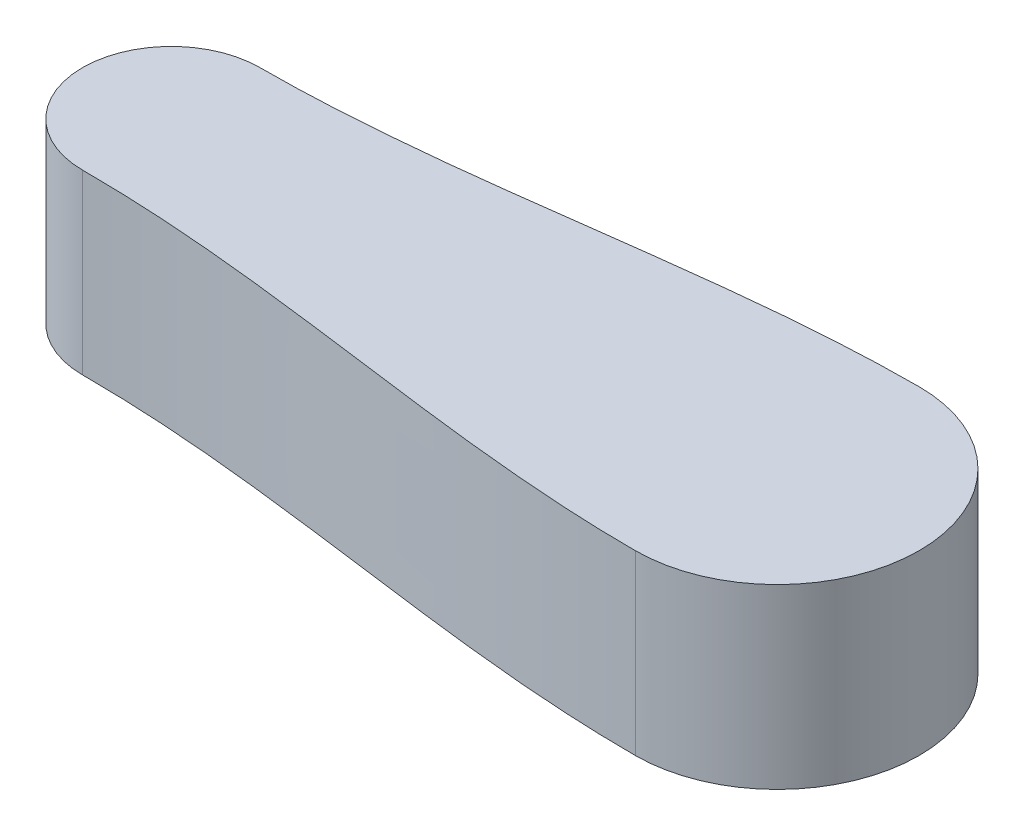
ISO-10303-21;
HEADER;
FILE_DESCRIPTION(('STEP AP214'),'2;1');
FILE_NAME('part.step','',(''),(''),'','','');
FILE_SCHEMA(('AUTOMOTIVE_DESIGN { 1 0 10303 214 1 1 1 1 }'));
ENDSEC;
DATA;
#1=APPLICATION_CONTEXT('core data for automotive mechanical design processes');
#2=APPLICATION_PROTOCOL_DEFINITION('international standard','automotive_design',2000,#1);
#3=PRODUCT_CONTEXT('',#1,'mechanical');
#4=PRODUCT('Part','Part','',(#3));
#5=PRODUCT_RELATED_PRODUCT_CATEGORY('part','',(#4));
#6=PRODUCT_DEFINITION_FORMATION('','',#4);
#7=PRODUCT_DEFINITION_CONTEXT('part definition',#1,'design');
#8=PRODUCT_DEFINITION('design','',#6,#7);
#9=PRODUCT_DEFINITION_SHAPE('','',#8);
#10=(LENGTH_UNIT() NAMED_UNIT(*) SI_UNIT(.MILLI.,.METRE.));
#11=(NAMED_UNIT(*) PLANE_ANGLE_UNIT() SI_UNIT($,.RADIAN.));
#12=(NAMED_UNIT(*) SI_UNIT($,.STERADIAN.) SOLID_ANGLE_UNIT());
#13=UNCERTAINTY_MEASURE_WITH_UNIT(LENGTH_MEASURE(1.E-05),#10,'distance_accuracy_value','');
#14=(GEOMETRIC_REPRESENTATION_CONTEXT(3) GLOBAL_UNCERTAINTY_ASSIGNED_CONTEXT((#13)) GLOBAL_UNIT_ASSIGNED_CONTEXT((#10,
#11,#12)) REPRESENTATION_CONTEXT('',''));
#15=CARTESIAN_POINT('',(0.,0.,0.));
#16=DIRECTION('',(0.,0.,1.));
#17=DIRECTION('',(1.,0.,0.));
#18=AXIS2_PLACEMENT_3D('',#15,#16,#17);
#19=CARTESIAN_POINT('',(195.775010008008,50.,-65.));
#20=CARTESIAN_POINT('',(138.630841409594,50.,-65.));
#21=CARTESIAN_POINT('',(82.5808307653546,50.,-50.));
#22=CARTESIAN_POINT('',(25.,50.,-50.));
#23=B_SPLINE_CURVE_WITH_KNOTS('',3,(#19,#20,#21,#22),.UNSPECIFIED.,.F.,.F.,(4,4),(0.,1.),.UNSPECIFIED.);
#24=DIRECTION('',(0.,-1.,0.));
#25=VECTOR('',#24,1.);
#26=SURFACE_OF_LINEAR_EXTRUSION('',#23,#25);
#27=CARTESIAN_POINT('',(195.775010008008,0.,-65.));
#28=CARTESIAN_POINT('',(138.630841409594,0.,-65.));
#29=CARTESIAN_POINT('',(82.5808307653546,0.,-50.));
#30=CARTESIAN_POINT('',(25.,0.,-50.));
#31=B_SPLINE_CURVE_WITH_KNOTS('',3,(#27,#28,#29,#30),.UNSPECIFIED.,.F.,.F.,(4,4),(0.,1.),.UNSPECIFIED.);
#32=CARTESIAN_POINT('',(195.775010008008,0.,-65.));
#33=VERTEX_POINT('',#32);
#34=CARTESIAN_POINT('',(25.,0.,-50.));
#35=VERTEX_POINT('',#34);
#36=EDGE_CURVE('E108',#33,#35,#31,.T.);
#37=ORIENTED_EDGE('',*,*,#36,.T.);
#38=DIRECTION('',(0.,-1.,0.));
#39=VECTOR('',#38,1.);
#40=CARTESIAN_POINT('',(25.,50.,-50.));
#41=LINE('',#40,#39);
#42=CARTESIAN_POINT('',(25.,50.,-50.));
#43=VERTEX_POINT('',#42);
#44=EDGE_CURVE('E11',#43,#35,#41,.T.);
#45=ORIENTED_EDGE('',*,*,#44,.F.);
#46=CARTESIAN_POINT('',(195.775010008008,50.,-65.));
#47=VERTEX_POINT('',#46);
#48=EDGE_CURVE('E109',#47,#43,#23,.T.);
#49=ORIENTED_EDGE('',*,*,#48,.F.);
#50=DIRECTION('',(0.,-1.,0.));
#51=VECTOR('',#50,1.);
#52=CARTESIAN_POINT('',(195.775010008008,50.,-65.));
#53=LINE('',#52,#51);
#54=EDGE_CURVE('E156',#47,#33,#53,.T.);
#55=ORIENTED_EDGE('',*,*,#54,.T.);
#56=EDGE_LOOP('',(#37,#45,#49,#55));
#57=FACE_BOUND('',#56,.T.);
#58=ADVANCED_FACE('F33',(#57),#26,.F.);
#59=CARTESIAN_POINT('',(25.,50.,-25.));
#60=DIRECTION('',(0.,-1.,0.));
#61=DIRECTION('',(0.,0.,-1.));
#62=AXIS2_PLACEMENT_3D('',#59,#60,#61);
#63=CYLINDRICAL_SURFACE('',#62,25.);
#64=CARTESIAN_POINT('',(25.,0.,-25.));
#65=DIRECTION('',(0.,1.,0.));
#66=DIRECTION('',(0.,0.,1.));
#67=AXIS2_PLACEMENT_3D('',#64,#65,#66);
#68=CIRCLE('',#67,25.);
#69=CARTESIAN_POINT('',(25.,0.,0.));
#70=VERTEX_POINT('',#69);
#71=EDGE_CURVE('E139',#35,#70,#68,.T.);
#72=ORIENTED_EDGE('',*,*,#71,.T.);
#73=DIRECTION('',(0.,-1.,0.));
#74=VECTOR('',#73,1.);
#75=CARTESIAN_POINT('',(25.,50.,0.));
#76=LINE('',#75,#74);
#77=CARTESIAN_POINT('',(25.,50.,0.));
#78=VERTEX_POINT('',#77);
#79=EDGE_CURVE('E42',#78,#70,#76,.T.);
#80=ORIENTED_EDGE('',*,*,#79,.F.);
#81=CARTESIAN_POINT('',(25.,50.,-25.));
#82=DIRECTION('',(0.,1.,0.));
#83=DIRECTION('',(0.,0.,1.));
#84=AXIS2_PLACEMENT_3D('',#81,#82,#83);
#85=CIRCLE('',#84,25.);
#86=EDGE_CURVE('E81',#43,#78,#85,.T.);
#87=ORIENTED_EDGE('',*,*,#86,.F.);
#88=ORIENTED_EDGE('',*,*,#44,.T.);
#89=EDGE_LOOP('',(#72,#80,#87,#88));
#90=FACE_BOUND('',#89,.T.);
#91=ADVANCED_FACE('F132',(#90),#63,.T.);
#92=CARTESIAN_POINT('',(25.,50.,0.));
#93=CARTESIAN_POINT('',(82.5808307653546,50.,0.));
#94=CARTESIAN_POINT('',(138.630841409594,50.,15.));
#95=CARTESIAN_POINT('',(195.775010008008,50.,15.));
#96=B_SPLINE_CURVE_WITH_KNOTS('',3,(#92,#93,#94,#95),.UNSPECIFIED.,.F.,.F.,(4,4),(0.,1.),.UNSPECIFIED.);
#97=DIRECTION('',(0.,-1.,0.));
#98=VECTOR('',#97,1.);
#99=SURFACE_OF_LINEAR_EXTRUSION('',#96,#98);
#100=CARTESIAN_POINT('',(25.,0.,0.));
#101=CARTESIAN_POINT('',(82.5808307653546,0.,0.));
#102=CARTESIAN_POINT('',(138.630841409594,0.,15.));
#103=CARTESIAN_POINT('',(195.775010008008,0.,15.));
#104=B_SPLINE_CURVE_WITH_KNOTS('',3,(#100,#101,#102,#103),.UNSPECIFIED.,.F.,.F.,(4,4),(0.,1.),.UNSPECIFIED.);
#105=CARTESIAN_POINT('',(195.775010008008,0.,15.));
#106=VERTEX_POINT('',#105);
#107=EDGE_CURVE('E68',#70,#106,#104,.T.);
#108=ORIENTED_EDGE('',*,*,#107,.T.);
#109=DIRECTION('',(0.,-1.,0.));
#110=VECTOR('',#109,1.);
#111=CARTESIAN_POINT('',(195.775010008008,50.,15.));
#112=LINE('',#111,#110);
#113=CARTESIAN_POINT('',(195.775010008008,50.,15.));
#114=VERTEX_POINT('',#113);
#115=EDGE_CURVE('E146',#114,#106,#112,.T.);
#116=ORIENTED_EDGE('',*,*,#115,.F.);
#117=EDGE_CURVE('E118',#78,#114,#96,.T.);
#118=ORIENTED_EDGE('',*,*,#117,.F.);
#119=ORIENTED_EDGE('',*,*,#79,.T.);
#120=EDGE_LOOP('',(#108,#116,#118,#119));
#121=FACE_BOUND('',#120,.T.);
#122=ADVANCED_FACE('F128',(#121),#99,.F.);
#123=CARTESIAN_POINT('',(195.775010008008,50.,-25.));
#124=DIRECTION('',(0.,-1.,0.));
#125=DIRECTION('',(0.,0.,-1.));
#126=AXIS2_PLACEMENT_3D('',#123,#124,#125);
#127=CYLINDRICAL_SURFACE('',#126,40.);
#128=CARTESIAN_POINT('',(195.775010008008,0.,-25.));
#129=DIRECTION('',(0.,1.,0.));
#130=DIRECTION('',(0.,0.,1.));
#131=AXIS2_PLACEMENT_3D('',#128,#129,#130);
#132=CIRCLE('',#131,40.);
#133=EDGE_CURVE('E74',#106,#33,#132,.T.);
#134=ORIENTED_EDGE('',*,*,#133,.T.);
#135=ORIENTED_EDGE('',*,*,#54,.F.);
#136=CARTESIAN_POINT('',(195.775010008008,50.,-25.));
#137=DIRECTION('',(0.,1.,0.));
#138=DIRECTION('',(0.,0.,1.));
#139=AXIS2_PLACEMENT_3D('',#136,#137,#138);
#140=CIRCLE('',#139,40.);
#141=EDGE_CURVE('E50',#114,#47,#140,.T.);
#142=ORIENTED_EDGE('',*,*,#141,.F.);
#143=ORIENTED_EDGE('',*,*,#115,.T.);
#144=EDGE_LOOP('',(#134,#135,#142,#143));
#145=FACE_BOUND('',#144,.T.);
#146=ADVANCED_FACE('F131',(#145),#127,.T.);
#147=CARTESIAN_POINT('',(110.551253316607,50.,-57.5));
#148=DIRECTION('',(0.,-1.,0.));
#149=DIRECTION('',(0.,0.,-1.));
#150=AXIS2_PLACEMENT_3D('',#147,#148,#149);
#151=PLANE('',#150);
#152=ORIENTED_EDGE('',*,*,#48,.T.);
#153=ORIENTED_EDGE('',*,*,#86,.T.);
#154=ORIENTED_EDGE('',*,*,#117,.T.);
#155=ORIENTED_EDGE('',*,*,#141,.T.);
#156=EDGE_LOOP('',(#152,#153,#154,#155));
#157=FACE_BOUND('',#156,.T.);
#158=ADVANCED_FACE('F159',(#157),#151,.F.);
#159=CARTESIAN_POINT('',(110.551253316607,0.,-57.5));
#160=DIRECTION('',(0.,-1.,0.));
#161=DIRECTION('',(0.,0.,-1.));
#162=AXIS2_PLACEMENT_3D('',#159,#160,#161);
#163=PLANE('',#162);
#164=CARTESIAN_POINT('',(162.775010008008,0.,-3.));
#165=DIRECTION('',(0.,-1.,0.));
#166=DIRECTION('',(0.,0.,-1.));
#167=AXIS2_PLACEMENT_3D('',#164,#165,#166);
#168=CIRCLE('',#167,2.09999999999999);
#169=CARTESIAN_POINT('',(162.775010008008,0.,-5.09999999999999));
#170=VERTEX_POINT('',#169);
#171=EDGE_CURVE('E99',#170,#170,#168,.T.);
#172=ORIENTED_EDGE('',*,*,#171,.F.);
#173=EDGE_LOOP('',(#172));
#174=FACE_BOUND('',#173,.T.);
#175=CARTESIAN_POINT('',(162.775010008008,0.,-47.));
#176=DIRECTION('',(0.,-1.,0.));
#177=DIRECTION('',(0.,0.,-1.));
#178=AXIS2_PLACEMENT_3D('',#175,#176,#177);
#179=CIRCLE('',#178,2.09999999999999);
#180=CARTESIAN_POINT('',(162.775010008008,0.,-49.1));
#181=VERTEX_POINT('',#180);
#182=EDGE_CURVE('E98',#181,#181,#179,.T.);
#183=ORIENTED_EDGE('',*,*,#182,.F.);
#184=EDGE_LOOP('',(#183));
#185=FACE_BOUND('',#184,.T.);
#186=ORIENTED_EDGE('',*,*,#36,.F.);
#187=ORIENTED_EDGE('',*,*,#133,.F.);
#188=ORIENTED_EDGE('',*,*,#107,.F.);
#189=ORIENTED_EDGE('',*,*,#71,.F.);
#190=EDGE_LOOP('',(#186,#187,#188,#189));
#191=FACE_BOUND('',#190,.T.);
#192=ADVANCED_FACE('F147',(#174,#185,#191),#163,.T.);
#193=CARTESIAN_POINT('',(162.775010008008,14.,-47.));
#194=DIRECTION('',(0.,-1.,0.));
#195=DIRECTION('',(0.,0.,-1.));
#196=AXIS2_PLACEMENT_3D('',#193,#194,#195);
#197=CONICAL_SURFACE('',#196,2.09999999999999,1.02974425867665);
#198=CARTESIAN_POINT('',(162.775010008008,15.2618072999579,-47.));
#199=VERTEX_POINT('',#198);
#200=VERTEX_LOOP('',#199);
#201=FACE_BOUND('',#200,.T.);
#202=CARTESIAN_POINT('',(162.775010008008,14.,-47.));
#203=DIRECTION('',(0.,-1.,0.));
#204=DIRECTION('',(0.,0.,-1.));
#205=AXIS2_PLACEMENT_3D('',#202,#203,#204);
#206=CIRCLE('',#205,2.09999999999999);
#207=CARTESIAN_POINT('',(162.775010008008,14.,-49.1));
#208=VERTEX_POINT('',#207);
#209=EDGE_CURVE('E102',#208,#208,#206,.T.);
#210=ORIENTED_EDGE('',*,*,#209,.T.);
#211=EDGE_LOOP('',(#210));
#212=FACE_BOUND('',#211,.T.);
#213=ADVANCED_FACE('F166',(#201,#212),#197,.F.);
#214=CARTESIAN_POINT('',(162.775010008008,0.,-47.));
#215=DIRECTION('',(0.,-1.,0.));
#216=DIRECTION('',(0.,0.,-1.));
#217=AXIS2_PLACEMENT_3D('',#214,#215,#216);
#218=CYLINDRICAL_SURFACE('',#217,2.09999999999999);
#219=ORIENTED_EDGE('',*,*,#209,.F.);
#220=EDGE_LOOP('',(#219));
#221=FACE_BOUND('',#220,.T.);
#222=ORIENTED_EDGE('',*,*,#182,.T.);
#223=EDGE_LOOP('',(#222));
#224=FACE_BOUND('',#223,.T.);
#225=ADVANCED_FACE('F92',(#221,#224),#218,.F.);
#226=CARTESIAN_POINT('',(162.775010008008,14.,-3.));
#227=DIRECTION('',(0.,-1.,0.));
#228=DIRECTION('',(0.,0.,-1.));
#229=AXIS2_PLACEMENT_3D('',#226,#227,#228);
#230=CONICAL_SURFACE('',#229,2.09999999999999,1.02974425867665);
#231=CARTESIAN_POINT('',(162.775010008008,15.2618072999579,-3.));
#232=VERTEX_POINT('',#231);
#233=VERTEX_LOOP('',#232);
#234=FACE_BOUND('',#233,.T.);
#235=CARTESIAN_POINT('',(162.775010008008,14.,-3.));
#236=DIRECTION('',(0.,-1.,0.));
#237=DIRECTION('',(0.,0.,-1.));
#238=AXIS2_PLACEMENT_3D('',#235,#236,#237);
#239=CIRCLE('',#238,2.09999999999999);
#240=CARTESIAN_POINT('',(162.775010008008,14.,-5.09999999999999));
#241=VERTEX_POINT('',#240);
#242=EDGE_CURVE('E96',#241,#241,#239,.T.);
#243=ORIENTED_EDGE('',*,*,#242,.T.);
#244=EDGE_LOOP('',(#243));
#245=FACE_BOUND('',#244,.T.);
#246=ADVANCED_FACE('F88',(#234,#245),#230,.F.);
#247=CARTESIAN_POINT('',(162.775010008008,0.,-3.));
#248=DIRECTION('',(0.,-1.,0.));
#249=DIRECTION('',(0.,0.,-1.));
#250=AXIS2_PLACEMENT_3D('',#247,#248,#249);
#251=CYLINDRICAL_SURFACE('',#250,2.09999999999999);
#252=ORIENTED_EDGE('',*,*,#242,.F.);
#253=EDGE_LOOP('',(#252));
#254=FACE_BOUND('',#253,.T.);
#255=ORIENTED_EDGE('',*,*,#171,.T.);
#256=EDGE_LOOP('',(#255));
#257=FACE_BOUND('',#256,.T.);
#258=ADVANCED_FACE('F91',(#254,#257),#251,.F.);
#259=CLOSED_SHELL('',(#58,#91,#122,#146,#158,#192,#213,#225,#246,#258));
#260=MANIFOLD_SOLID_BREP('B2',#259);
#261=ADVANCED_BREP_SHAPE_REPRESENTATION('',(#18,#260),#14);
#262=SHAPE_DEFINITION_REPRESENTATION(#9,#261);
ENDSEC;
END-ISO-10303-21;
